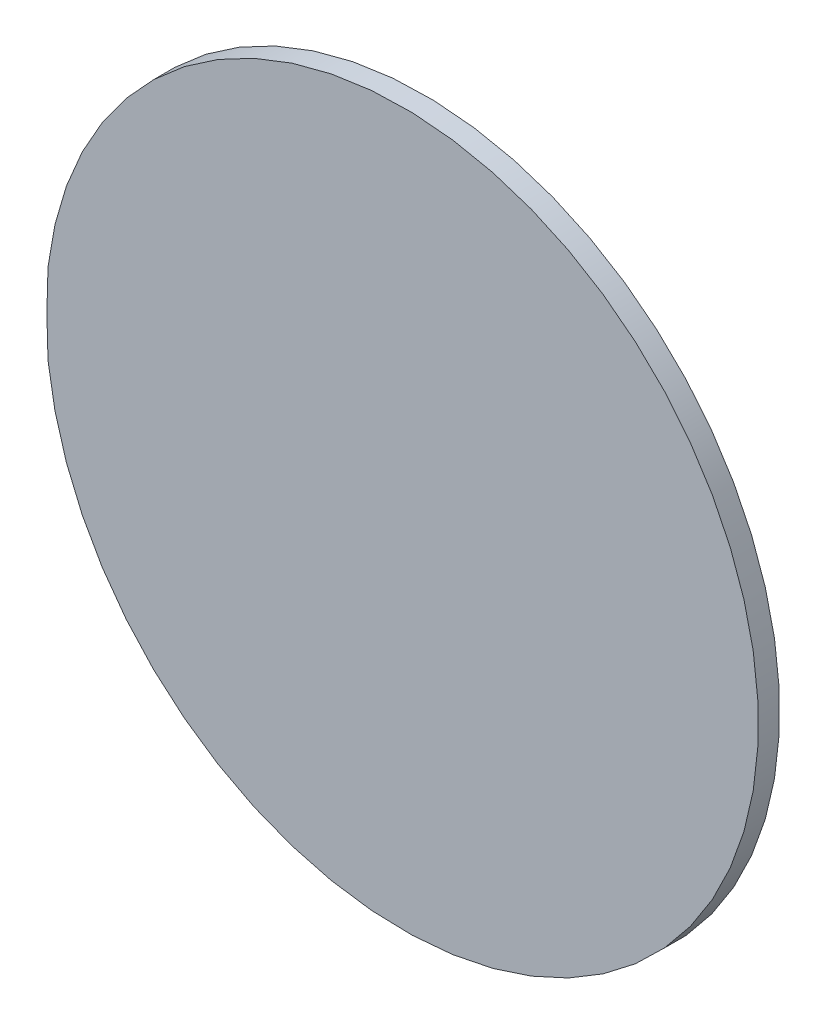
ISO-10303-21;
HEADER;
FILE_DESCRIPTION(('STEP AP214'),'2;1');
FILE_NAME('part.step','',(''),(''),'','','');
FILE_SCHEMA(('AUTOMOTIVE_DESIGN { 1 0 10303 214 1 1 1 1 }'));
ENDSEC;
DATA;
#1=APPLICATION_CONTEXT('core data for automotive mechanical design processes');
#2=APPLICATION_PROTOCOL_DEFINITION('international standard','automotive_design',2000,#1);
#3=PRODUCT_CONTEXT('',#1,'mechanical');
#4=PRODUCT('Part','Part','',(#3));
#5=PRODUCT_RELATED_PRODUCT_CATEGORY('part','',(#4));
#6=PRODUCT_DEFINITION_FORMATION('','',#4);
#7=PRODUCT_DEFINITION_CONTEXT('part definition',#1,'design');
#8=PRODUCT_DEFINITION('design','',#6,#7);
#9=PRODUCT_DEFINITION_SHAPE('','',#8);
#10=(LENGTH_UNIT() NAMED_UNIT(*) SI_UNIT(.MILLI.,.METRE.));
#11=(NAMED_UNIT(*) PLANE_ANGLE_UNIT() SI_UNIT($,.RADIAN.));
#12=(NAMED_UNIT(*) SI_UNIT($,.STERADIAN.) SOLID_ANGLE_UNIT());
#13=UNCERTAINTY_MEASURE_WITH_UNIT(LENGTH_MEASURE(1.E-05),#10,'distance_accuracy_value','');
#14=(GEOMETRIC_REPRESENTATION_CONTEXT(3) GLOBAL_UNCERTAINTY_ASSIGNED_CONTEXT((#13)) GLOBAL_UNIT_ASSIGNED_CONTEXT((#10,
#11,#12)) REPRESENTATION_CONTEXT('',''));
#15=CARTESIAN_POINT('',(0.,0.,0.));
#16=DIRECTION('',(0.,0.,1.));
#17=DIRECTION('',(1.,0.,0.));
#18=AXIS2_PLACEMENT_3D('',#15,#16,#17);
#19=CARTESIAN_POINT('',(-0.803,0.5,1.651));
#20=DIRECTION('',(0.,0.,1.));
#21=DIRECTION('',(1.,0.,0.));
#22=AXIS2_PLACEMENT_3D('',#19,#20,#21);
#23=CYLINDRICAL_SURFACE('',#22,0.050165);
#24=CARTESIAN_POINT('',(-0.803,0.5,1.654));
#25=DIRECTION('',(0.,0.,1.));
#26=DIRECTION('',(1.,0.,0.));
#27=AXIS2_PLACEMENT_3D('',#24,#25,#26);
#28=CIRCLE('',#27,0.050165);
#29=CARTESIAN_POINT('',(-0.853,0.5,1.654));
#30=VERTEX_POINT('',#29);
#31=EDGE_CURVE('E11',#30,#30,#28,.T.);
#32=ORIENTED_EDGE('',*,*,#31,.F.);
#33=CARTESIAN_POINT('',(-0.853165,0.5,1.651));
#34=CARTESIAN_POINT('',(-0.853165,0.5,1.654));
#35=B_SPLINE_CURVE_WITH_KNOTS('',1,(#33,#34),.UNSPECIFIED.,.F.,.F.,(2,2),(0.,
0.0029999999999999),.UNSPECIFIED.);
#36=CARTESIAN_POINT('',(-0.853,0.5,1.651));
#37=VERTEX_POINT('',#36);
#38=EDGE_CURVE('E24',#37,#30,#35,.T.);
#39=ORIENTED_EDGE('',*,*,#38,.F.);
#40=CARTESIAN_POINT('',(-0.803,0.5,1.651));
#41=DIRECTION('',(0.,0.,-1.));
#42=DIRECTION('',(1.,0.,0.));
#43=AXIS2_PLACEMENT_3D('',#40,#41,#42);
#44=CIRCLE('',#43,0.050165);
#45=EDGE_CURVE('E33',#37,#37,#44,.T.);
#46=ORIENTED_EDGE('',*,*,#45,.F.);
#47=ORIENTED_EDGE('',*,*,#38,.T.);
#48=EDGE_LOOP('',(#32,#39,#46,#47));
#49=FACE_BOUND('',#48,.T.);
#50=ADVANCED_FACE('F17',(#49),#23,.T.);
#51=CARTESIAN_POINT('',(-0.803,0.5,1.651));
#52=DIRECTION('',(0.,0.,1.));
#53=DIRECTION('',(0.,1.,0.));
#54=AXIS2_PLACEMENT_3D('',#51,#52,#53);
#55=PLANE('',#54);
#56=ORIENTED_EDGE('',*,*,#45,.T.);
#57=EDGE_LOOP('',(#56));
#58=FACE_BOUND('',#57,.T.);
#59=ADVANCED_FACE('F36',(#58),#55,.F.);
#60=CARTESIAN_POINT('',(-0.803,0.5,1.654));
#61=DIRECTION('',(0.,0.,1.));
#62=DIRECTION('',(0.,1.,0.));
#63=AXIS2_PLACEMENT_3D('',#60,#61,#62);
#64=PLANE('',#63);
#65=ORIENTED_EDGE('',*,*,#31,.T.);
#66=EDGE_LOOP('',(#65));
#67=FACE_BOUND('',#66,.T.);
#68=ADVANCED_FACE('F49',(#67),#64,.T.);
#69=CLOSED_SHELL('',(#50,#59,#68));
#70=MANIFOLD_SOLID_BREP('B1',#69);
#71=ADVANCED_BREP_SHAPE_REPRESENTATION('',(#18,#70),#14);
#72=SHAPE_DEFINITION_REPRESENTATION(#9,#71);
ENDSEC;
END-ISO-10303-21;
